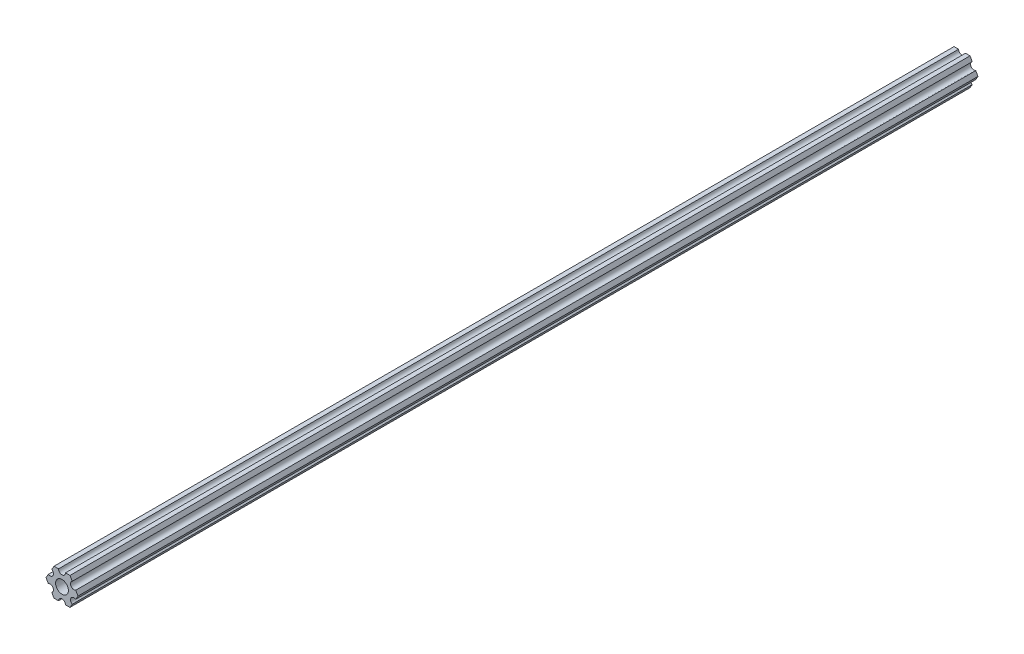
ISO-10303-21;
HEADER;
FILE_DESCRIPTION(('STEP AP214'),'2;1');
FILE_NAME('part.step','',(''),(''),'','','');
FILE_SCHEMA(('AUTOMOTIVE_DESIGN { 1 0 10303 214 1 1 1 1 }'));
ENDSEC;
DATA;
#1=APPLICATION_CONTEXT('core data for automotive mechanical design processes');
#2=APPLICATION_PROTOCOL_DEFINITION('international standard','automotive_design',2000,#1);
#3=PRODUCT_CONTEXT('',#1,'mechanical');
#4=PRODUCT('Part','Part','',(#3));
#5=PRODUCT_RELATED_PRODUCT_CATEGORY('part','',(#4));
#6=PRODUCT_DEFINITION_FORMATION('','',#4);
#7=PRODUCT_DEFINITION_CONTEXT('part definition',#1,'design');
#8=PRODUCT_DEFINITION('design','',#6,#7);
#9=PRODUCT_DEFINITION_SHAPE('','',#8);
#10=(LENGTH_UNIT() NAMED_UNIT(*) SI_UNIT(.MILLI.,.METRE.));
#11=(NAMED_UNIT(*) PLANE_ANGLE_UNIT() SI_UNIT($,.RADIAN.));
#12=(NAMED_UNIT(*) SI_UNIT($,.STERADIAN.) SOLID_ANGLE_UNIT());
#13=UNCERTAINTY_MEASURE_WITH_UNIT(LENGTH_MEASURE(1.E-05),#10,'distance_accuracy_value','');
#14=(GEOMETRIC_REPRESENTATION_CONTEXT(3) GLOBAL_UNCERTAINTY_ASSIGNED_CONTEXT((#13)) GLOBAL_UNIT_ASSIGNED_CONTEXT((#10,
#11,#12)) REPRESENTATION_CONTEXT('',''));
#15=CARTESIAN_POINT('',(0.,0.,0.));
#16=DIRECTION('',(0.,0.,1.));
#17=DIRECTION('',(1.,0.,0.));
#18=AXIS2_PLACEMENT_3D('',#15,#16,#17);
#19=CARTESIAN_POINT('',(6.29301142309098,-1.80018429024546,412.75));
#20=DIRECTION('',(-0.866025434075728,0.499999947533944,0.));
#21=DIRECTION('',(-0.499999947533944,-0.866025434075728,0.));
#22=AXIS2_PLACEMENT_3D('',#19,#20,#21);
#23=PLANE('',#22);
#24=DIRECTION('',(0.,0.,1.));
#25=VECTOR('',#24,1.);
#26=CARTESIAN_POINT('',(7.33234841870825,4.44212536187977E-07,412.75));
#27=LINE('',#26,#25);
#28=CARTESIAN_POINT('',(7.33234841870825,4.4421253590961E-07,0.));
#29=VERTEX_POINT('',#28);
#30=CARTESIAN_POINT('',(7.33234841870825,4.4421253664489E-07,412.75));
#31=VERTEX_POINT('',#30);
#32=EDGE_CURVE('E249',#29,#31,#27,.T.);
#33=ORIENTED_EDGE('',*,*,#32,.T.);
#34=DIRECTION('',(0.499999947533944,0.866025434075728,0.));
#35=VECTOR('',#34,1.);
#36=CARTESIAN_POINT('',(6.29301142309098,-1.80018429024546,412.75));
#37=LINE('',#36,#35);
#38=CARTESIAN_POINT('',(6.29301142309098,-1.80018429024546,412.75));
#39=VERTEX_POINT('',#38);
#40=EDGE_CURVE('E170',#39,#31,#37,.T.);
#41=ORIENTED_EDGE('',*,*,#40,.F.);
#42=DIRECTION('',(0.,0.,-1.));
#43=VECTOR('',#42,1.);
#44=CARTESIAN_POINT('',(6.29301142309098,-1.80018429024546,412.75));
#45=LINE('',#44,#43);
#46=CARTESIAN_POINT('',(6.29301142309098,-1.80018429024546,0.));
#47=VERTEX_POINT('',#46);
#48=EDGE_CURVE('E210',#39,#47,#45,.T.);
#49=ORIENTED_EDGE('',*,*,#48,.T.);
#50=DIRECTION('',(0.499999947533944,0.866025434075728,0.));
#51=VECTOR('',#50,1.);
#52=CARTESIAN_POINT('',(6.29301142309098,-1.80018429024546,0.));
#53=LINE('',#52,#51);
#54=EDGE_CURVE('E172',#47,#29,#53,.T.);
#55=ORIENTED_EDGE('',*,*,#54,.T.);
#56=EDGE_LOOP('',(#33,#41,#49,#55));
#57=FACE_BOUND('',#56,.T.);
#58=ADVANCED_FACE('F14',(#57),#23,.F.);
#59=CARTESIAN_POINT('',(7.33234841870825,4.44212536187977E-07,412.75));
#60=DIRECTION('',(-0.866025373493146,-0.500000052466055,0.));
#61=DIRECTION('',(0.500000052466055,-0.866025373493146,0.));
#62=AXIS2_PLACEMENT_3D('',#59,#60,#61);
#63=PLANE('',#62);
#64=DIRECTION('',(0.,0.,-1.));
#65=VECTOR('',#64,1.);
#66=CARTESIAN_POINT('',(6.29301120497139,1.80018505273895,412.75));
#67=LINE('',#66,#65);
#68=CARTESIAN_POINT('',(6.29301120497139,1.80018505273895,0.));
#69=VERTEX_POINT('',#68);
#70=CARTESIAN_POINT('',(6.29301120497139,1.80018505273895,412.75));
#71=VERTEX_POINT('',#70);
#72=EDGE_CURVE('E247',#69,#71,#67,.F.);
#73=ORIENTED_EDGE('',*,*,#72,.T.);
#74=DIRECTION('',(-0.500000052466055,0.866025373493145,0.));
#75=VECTOR('',#74,1.);
#76=CARTESIAN_POINT('',(7.33234841870825,4.44212536112459E-07,412.75));
#77=LINE('',#76,#75);
#78=EDGE_CURVE('E61',#31,#71,#77,.T.);
#79=ORIENTED_EDGE('',*,*,#78,.F.);
#80=ORIENTED_EDGE('',*,*,#32,.F.);
#81=DIRECTION('',(-0.500000052466055,0.866025373493145,0.));
#82=VECTOR('',#81,1.);
#83=CARTESIAN_POINT('',(7.33234841870825,4.44212536112459E-07,0.));
#84=LINE('',#83,#82);
#85=EDGE_CURVE('E207',#29,#69,#84,.T.);
#86=ORIENTED_EDGE('',*,*,#85,.T.);
#87=EDGE_LOOP('',(#73,#79,#80,#86));
#88=FACE_BOUND('',#87,.T.);
#89=ADVANCED_FACE('F294',(#88),#63,.F.);
#90=CARTESIAN_POINT('',(5.49926112168156,3.17500033315933,412.75));
#91=DIRECTION('',(0.,0.,-1.));
#92=DIRECTION('',(-1.,0.,0.));
#93=AXIS2_PLACEMENT_3D('',#90,#91,#92);
#94=CYLINDRICAL_SURFACE('',#93,1.5875);
#95=CARTESIAN_POINT('',(5.49926112168156,3.17500033315933,412.75));
#96=DIRECTION('',(0.,0.,-1.));
#97=DIRECTION('',(-1.,0.,0.));
#98=AXIS2_PLACEMENT_3D('',#95,#96,#97);
#99=CIRCLE('',#98,1.5875);
#100=CARTESIAN_POINT('',(4.70551103839172,4.54981561357972,412.75));
#101=VERTEX_POINT('',#100);
#102=EDGE_CURVE('E53',#71,#101,#99,.T.);
#103=ORIENTED_EDGE('',*,*,#102,.F.);
#104=ORIENTED_EDGE('',*,*,#72,.F.);
#105=CARTESIAN_POINT('',(5.49926112168156,3.17500033315933,0.));
#106=DIRECTION('',(0.,0.,-1.));
#107=DIRECTION('',(-1.,0.,0.));
#108=AXIS2_PLACEMENT_3D('',#105,#106,#107);
#109=CIRCLE('',#108,1.5875);
#110=CARTESIAN_POINT('',(4.70551103839172,4.54981561357972,0.));
#111=VERTEX_POINT('',#110);
#112=EDGE_CURVE('E17',#69,#111,#109,.T.);
#113=ORIENTED_EDGE('',*,*,#112,.T.);
#114=DIRECTION('',(0.,0.,1.));
#115=VECTOR('',#114,1.);
#116=CARTESIAN_POINT('',(4.70551103839172,4.54981561357972,412.75));
#117=LINE('',#116,#115);
#118=EDGE_CURVE('E245',#111,#101,#117,.T.);
#119=ORIENTED_EDGE('',*,*,#118,.T.);
#120=EDGE_LOOP('',(#103,#104,#113,#119));
#121=FACE_BOUND('',#120,.T.);
#122=ADVANCED_FACE('F292',(#121),#94,.F.);
#123=CARTESIAN_POINT('',(4.70551103839172,4.54981561357972,412.75));
#124=DIRECTION('',(-0.866025373493151,-0.500000052466046,0.));
#125=DIRECTION('',(0.500000052466046,-0.866025373493151,0.));
#126=AXIS2_PLACEMENT_3D('',#123,#124,#125);
#127=PLANE('',#126);
#128=DIRECTION('',(0.,0.,1.));
#129=VECTOR('',#128,1.);
#130=CARTESIAN_POINT('',(3.66617382465481,6.35000022210627,412.75));
#131=LINE('',#130,#129);
#132=CARTESIAN_POINT('',(3.66617382465481,6.35000022210627,-1.29526019539602E-13));
#133=VERTEX_POINT('',#132);
#134=CARTESIAN_POINT('',(3.66617382465481,6.35000022210627,412.75));
#135=VERTEX_POINT('',#134);
#136=EDGE_CURVE('E242',#133,#135,#131,.T.);
#137=ORIENTED_EDGE('',*,*,#136,.T.);
#138=DIRECTION('',(-0.500000052466046,0.866025373493151,0.));
#139=VECTOR('',#138,1.);
#140=CARTESIAN_POINT('',(4.70551103839172,4.54981561357972,412.75));
#141=LINE('',#140,#139);
#142=EDGE_CURVE('E167',#101,#135,#141,.T.);
#143=ORIENTED_EDGE('',*,*,#142,.F.);
#144=ORIENTED_EDGE('',*,*,#118,.F.);
#145=DIRECTION('',(-0.500000052466046,0.866025373493151,0.));
#146=VECTOR('',#145,1.);
#147=CARTESIAN_POINT('',(4.70551103839172,4.54981561357972,0.));
#148=LINE('',#147,#146);
#149=EDGE_CURVE('E204',#111,#133,#148,.T.);
#150=ORIENTED_EDGE('',*,*,#149,.T.);
#151=EDGE_LOOP('',(#137,#143,#144,#150));
#152=FACE_BOUND('',#151,.T.);
#153=ADVANCED_FACE('F285',(#152),#127,.F.);
#154=CARTESIAN_POINT('',(3.66617382465481,6.35000022210627,412.75));
#155=DIRECTION('',(6.05825850611185E-08,-0.999999999999998,0.));
#156=DIRECTION('',(0.999999999999998,6.05825850611185E-08,0.));
#157=AXIS2_PLACEMENT_3D('',#154,#155,#156);
#158=PLANE('',#157);
#159=DIRECTION('',(0.,0.,-1.));
#160=VECTOR('',#159,1.);
#161=CARTESIAN_POINT('',(1.58749961530074,6.35000009617482,412.75));
#162=LINE('',#161,#160);
#163=CARTESIAN_POINT('',(1.58749961530073,6.35000015914054,0.));
#164=VERTEX_POINT('',#163);
#165=CARTESIAN_POINT('',(1.58749961530073,6.35000015914054,412.75));
#166=VERTEX_POINT('',#165);
#167=EDGE_CURVE('E240',#164,#166,#162,.F.);
#168=ORIENTED_EDGE('',*,*,#167,.T.);
#169=DIRECTION('',(1.,0.,0.));
#170=VECTOR('',#169,1.);
#171=CARTESIAN_POINT('',(5.49926112168156,6.35000022210627,412.75));
#172=LINE('',#171,#170);
#173=EDGE_CURVE('E142',#135,#166,#172,.F.);
#174=ORIENTED_EDGE('',*,*,#173,.F.);
#175=ORIENTED_EDGE('',*,*,#136,.F.);
#176=DIRECTION('',(1.,0.,0.));
#177=VECTOR('',#176,1.);
#178=CARTESIAN_POINT('',(5.49926112168156,6.35000022210627,0.));
#179=LINE('',#178,#177);
#180=EDGE_CURVE('E201',#133,#164,#179,.F.);
#181=ORIENTED_EDGE('',*,*,#180,.T.);
#182=EDGE_LOOP('',(#168,#174,#175,#181));
#183=FACE_BOUND('',#182,.T.);
#184=ADVANCED_FACE('F282',(#183),#158,.F.);
#185=CARTESIAN_POINT('',(-3.84699260060323E-07,6.35,412.75));
#186=DIRECTION('',(0.,0.,-1.));
#187=DIRECTION('',(-1.,0.,0.));
#188=AXIS2_PLACEMENT_3D('',#185,#186,#187);
#189=CYLINDRICAL_SURFACE('',#188,1.5875);
#190=DIRECTION('',(0.,0.,1.));
#191=VECTOR('',#190,1.);
#192=CARTESIAN_POINT('',(-1.58750038469926,6.34999990382518,412.75));
#193=LINE('',#192,#191);
#194=CARTESIAN_POINT('',(-1.58750038469926,6.34999990382518,0.));
#195=VERTEX_POINT('',#194);
#196=CARTESIAN_POINT('',(-1.58750038469926,6.34999990382518,412.75));
#197=VERTEX_POINT('',#196);
#198=EDGE_CURVE('E101',#195,#197,#193,.T.);
#199=ORIENTED_EDGE('',*,*,#198,.T.);
#200=CARTESIAN_POINT('',(-3.84699260060323E-07,6.35,412.75));
#201=DIRECTION('',(0.,0.,-1.));
#202=DIRECTION('',(-1.,0.,0.));
#203=AXIS2_PLACEMENT_3D('',#200,#201,#202);
#204=CIRCLE('',#203,1.5875);
#205=EDGE_CURVE('E146',#166,#197,#204,.T.);
#206=ORIENTED_EDGE('',*,*,#205,.F.);
#207=ORIENTED_EDGE('',*,*,#167,.F.);
#208=CARTESIAN_POINT('',(-3.84699260060323E-07,6.35,0.));
#209=DIRECTION('',(0.,0.,-1.));
#210=DIRECTION('',(-1.,0.,0.));
#211=AXIS2_PLACEMENT_3D('',#208,#209,#210);
#212=CIRCLE('',#211,1.5875);
#213=EDGE_CURVE('E200',#164,#195,#212,.T.);
#214=ORIENTED_EDGE('',*,*,#213,.T.);
#215=EDGE_LOOP('',(#199,#206,#207,#214));
#216=FACE_BOUND('',#215,.T.);
#217=ADVANCED_FACE('F276',(#216),#189,.F.);
#218=CARTESIAN_POINT('',(-1.58750038469926,6.34999990382518,412.75));
#219=DIRECTION('',(6.05825963273174E-08,-0.999999999999998,0.));
#220=DIRECTION('',(0.999999999999998,6.05825963273174E-08,0.));
#221=AXIS2_PLACEMENT_3D('',#218,#219,#220);
#222=PLANE('',#221);
#223=DIRECTION('',(0.,0.,1.));
#224=VECTOR('',#223,1.);
#225=CARTESIAN_POINT('',(-3.66617459405349,6.3499997778937,412.75));
#226=LINE('',#225,#224);
#227=CARTESIAN_POINT('',(-3.66617454558244,6.34999986184803,-1.29526019539602E-13));
#228=VERTEX_POINT('',#227);
#229=CARTESIAN_POINT('',(-3.66617454558244,6.34999986184803,412.75));
#230=VERTEX_POINT('',#229);
#231=EDGE_CURVE('E109',#228,#230,#226,.T.);
#232=ORIENTED_EDGE('',*,*,#231,.T.);
#233=DIRECTION('',(1.,0.,0.));
#234=VECTOR('',#233,1.);
#235=CARTESIAN_POINT('',(5.49926112168156,6.34999990382518,412.75));
#236=LINE('',#235,#234);
#237=EDGE_CURVE('E147',#197,#230,#236,.F.);
#238=ORIENTED_EDGE('',*,*,#237,.F.);
#239=ORIENTED_EDGE('',*,*,#198,.F.);
#240=DIRECTION('',(1.,0.,0.));
#241=VECTOR('',#240,1.);
#242=CARTESIAN_POINT('',(5.49926112168156,6.34999990382518,0.));
#243=LINE('',#242,#241);
#244=EDGE_CURVE('E154',#195,#228,#243,.F.);
#245=ORIENTED_EDGE('',*,*,#244,.T.);
#246=EDGE_LOOP('',(#232,#238,#239,#245));
#247=FACE_BOUND('',#246,.T.);
#248=ADVANCED_FACE('F153',(#247),#222,.F.);
#249=CARTESIAN_POINT('',(-3.66617459405349,6.3499997778937,412.75));
#250=DIRECTION('',(0.866025434075729,-0.499999947533942,0.));
#251=DIRECTION('',(0.499999947533942,0.866025434075729,0.));
#252=AXIS2_PLACEMENT_3D('',#249,#250,#251);
#253=PLANE('',#252);
#254=DIRECTION('',(0.,0.,-1.));
#255=VECTOR('',#254,1.);
#256=CARTESIAN_POINT('',(-4.70551158967065,4.54981504343587,412.75));
#257=LINE('',#256,#255);
#258=CARTESIAN_POINT('',(-4.70551158967065,4.54981504343587,0.));
#259=VERTEX_POINT('',#258);
#260=CARTESIAN_POINT('',(-4.70551158967065,4.54981504343587,412.75));
#261=VERTEX_POINT('',#260);
#262=EDGE_CURVE('E155',#259,#261,#257,.F.);
#263=ORIENTED_EDGE('',*,*,#262,.T.);
#264=DIRECTION('',(-0.499999947533943,-0.866025434075729,0.));
#265=VECTOR('',#264,1.);
#266=CARTESIAN_POINT('',(-3.66617459405349,6.3499997778937,412.75));
#267=LINE('',#266,#265);
#268=EDGE_CURVE('E150',#230,#261,#267,.T.);
#269=ORIENTED_EDGE('',*,*,#268,.F.);
#270=ORIENTED_EDGE('',*,*,#231,.F.);
#271=DIRECTION('',(-0.499999947533943,-0.866025434075729,0.));
#272=VECTOR('',#271,1.);
#273=CARTESIAN_POINT('',(-3.66617459405349,6.3499997778937,0.));
#274=LINE('',#273,#272);
#275=EDGE_CURVE('E197',#228,#259,#274,.T.);
#276=ORIENTED_EDGE('',*,*,#275,.T.);
#277=EDGE_LOOP('',(#263,#269,#270,#276));
#278=FACE_BOUND('',#277,.T.);
#279=ADVANCED_FACE('F157',(#278),#253,.F.);
#280=CARTESIAN_POINT('',(-5.49926150638082,3.17499966684067,412.75));
#281=DIRECTION('',(0.,0.,-1.));
#282=DIRECTION('',(-1.,0.,0.));
#283=AXIS2_PLACEMENT_3D('',#280,#281,#282);
#284=CYLINDRICAL_SURFACE('',#283,1.5875);
#285=DIRECTION('',(0.,0.,1.));
#286=VECTOR('',#285,1.);
#287=CARTESIAN_POINT('',(-6.29301142309098,1.80018429024547,412.75));
#288=LINE('',#287,#286);
#289=CARTESIAN_POINT('',(-6.29301142309098,1.80018429024547,0.));
#290=VERTEX_POINT('',#289);
#291=CARTESIAN_POINT('',(-6.29301142309098,1.80018429024547,412.75));
#292=VERTEX_POINT('',#291);
#293=EDGE_CURVE('E235',#290,#292,#288,.T.);
#294=ORIENTED_EDGE('',*,*,#293,.T.);
#295=CARTESIAN_POINT('',(-5.49926150638082,3.17499966684067,412.75));
#296=DIRECTION('',(0.,0.,-1.));
#297=DIRECTION('',(-1.,0.,0.));
#298=AXIS2_PLACEMENT_3D('',#295,#296,#297);
#299=CIRCLE('',#298,1.5875);
#300=EDGE_CURVE('E159',#261,#292,#299,.T.);
#301=ORIENTED_EDGE('',*,*,#300,.F.);
#302=ORIENTED_EDGE('',*,*,#262,.F.);
#303=CARTESIAN_POINT('',(-5.49926150638082,3.17499966684067,0.));
#304=DIRECTION('',(0.,0.,-1.));
#305=DIRECTION('',(-1.,0.,0.));
#306=AXIS2_PLACEMENT_3D('',#303,#304,#305);
#307=CIRCLE('',#306,1.5875);
#308=EDGE_CURVE('E196',#259,#290,#307,.T.);
#309=ORIENTED_EDGE('',*,*,#308,.T.);
#310=EDGE_LOOP('',(#294,#301,#302,#309));
#311=FACE_BOUND('',#310,.T.);
#312=ADVANCED_FACE('F346',(#311),#284,.F.);
#313=CARTESIAN_POINT('',(-6.29301142309098,1.80018429024547,412.75));
#314=DIRECTION('',(0.866025434075724,-0.499999947533951,0.));
#315=DIRECTION('',(0.499999947533951,0.866025434075724,0.));
#316=AXIS2_PLACEMENT_3D('',#313,#314,#315);
#317=PLANE('',#316);
#318=DIRECTION('',(0.,0.,1.));
#319=VECTOR('',#318,1.);
#320=CARTESIAN_POINT('',(-7.33234841870826,-4.44212523790841E-07,412.75));
#321=LINE('',#320,#319);
#322=CARTESIAN_POINT('',(-7.33234841870826,-4.44212524036367E-07,0.));
#323=VERTEX_POINT('',#322);
#324=CARTESIAN_POINT('',(-7.33234841870826,-4.44212524036367E-07,412.75));
#325=VERTEX_POINT('',#324);
#326=EDGE_CURVE('E232',#323,#325,#321,.T.);
#327=ORIENTED_EDGE('',*,*,#326,.T.);
#328=DIRECTION('',(-0.499999947533952,-0.866025434075724,0.));
#329=VECTOR('',#328,1.);
#330=CARTESIAN_POINT('',(-6.29301142309098,1.80018429024547,412.75));
#331=LINE('',#330,#329);
#332=EDGE_CURVE('E161',#292,#325,#331,.T.);
#333=ORIENTED_EDGE('',*,*,#332,.F.);
#334=ORIENTED_EDGE('',*,*,#293,.F.);
#335=DIRECTION('',(-0.499999947533952,-0.866025434075724,0.));
#336=VECTOR('',#335,1.);
#337=CARTESIAN_POINT('',(-6.29301142309098,1.80018429024547,0.));
#338=LINE('',#337,#336);
#339=EDGE_CURVE('E193',#290,#323,#338,.T.);
#340=ORIENTED_EDGE('',*,*,#339,.T.);
#341=EDGE_LOOP('',(#327,#333,#334,#340));
#342=FACE_BOUND('',#341,.T.);
#343=ADVANCED_FACE('F314',(#342),#317,.F.);
#344=CARTESIAN_POINT('',(-7.33234841870826,-4.44212523790841E-07,412.75));
#345=DIRECTION('',(0.866025373493151,0.500000052466045,0.));
#346=DIRECTION('',(-0.500000052466045,0.866025373493151,0.));
#347=AXIS2_PLACEMENT_3D('',#344,#345,#346);
#348=PLANE('',#347);
#349=DIRECTION('',(0.,0.,-1.));
#350=VECTOR('',#349,1.);
#351=CARTESIAN_POINT('',(-6.29301120497141,-1.80018505273896,412.75));
#352=LINE('',#351,#350);
#353=CARTESIAN_POINT('',(-6.29301120497141,-1.80018505273896,0.));
#354=VERTEX_POINT('',#353);
#355=CARTESIAN_POINT('',(-6.29301120497141,-1.80018505273896,412.75));
#356=VERTEX_POINT('',#355);
#357=EDGE_CURVE('E229',#354,#356,#352,.F.);
#358=ORIENTED_EDGE('',*,*,#357,.T.);
#359=DIRECTION('',(0.500000052466045,-0.866025373493151,0.));
#360=VECTOR('',#359,1.);
#361=CARTESIAN_POINT('',(-7.33234841870826,-4.44212523969395E-07,412.75));
#362=LINE('',#361,#360);
#363=EDGE_CURVE('E262',#325,#356,#362,.T.);
#364=ORIENTED_EDGE('',*,*,#363,.F.);
#365=ORIENTED_EDGE('',*,*,#326,.F.);
#366=DIRECTION('',(0.500000052466045,-0.866025373493151,0.));
#367=VECTOR('',#366,1.);
#368=CARTESIAN_POINT('',(-7.33234841870826,-4.44212523969395E-07,0.));
#369=LINE('',#368,#367);
#370=EDGE_CURVE('E190',#323,#354,#369,.T.);
#371=ORIENTED_EDGE('',*,*,#370,.T.);
#372=EDGE_LOOP('',(#358,#364,#365,#371));
#373=FACE_BOUND('',#372,.T.);
#374=ADVANCED_FACE('F318',(#373),#348,.F.);
#375=CARTESIAN_POINT('',(-5.49926112168156,-3.17500033315934,412.75));
#376=DIRECTION('',(0.,0.,-1.));
#377=DIRECTION('',(-1.,0.,0.));
#378=AXIS2_PLACEMENT_3D('',#375,#376,#377);
#379=CYLINDRICAL_SURFACE('',#378,1.5875);
#380=DIRECTION('',(0.,0.,1.));
#381=VECTOR('',#380,1.);
#382=CARTESIAN_POINT('',(-4.70551103839172,-4.54981561357972,412.75));
#383=LINE('',#382,#381);
#384=CARTESIAN_POINT('',(-4.70551103839172,-4.54981561357972,0.));
#385=VERTEX_POINT('',#384);
#386=CARTESIAN_POINT('',(-4.70551103839172,-4.54981561357972,412.75));
#387=VERTEX_POINT('',#386);
#388=EDGE_CURVE('E226',#385,#387,#383,.T.);
#389=ORIENTED_EDGE('',*,*,#388,.T.);
#390=CARTESIAN_POINT('',(-5.49926112168156,-3.17500033315934,412.75));
#391=DIRECTION('',(0.,0.,-1.));
#392=DIRECTION('',(-1.,0.,0.));
#393=AXIS2_PLACEMENT_3D('',#390,#391,#392);
#394=CIRCLE('',#393,1.5875);
#395=EDGE_CURVE('E260',#356,#387,#394,.T.);
#396=ORIENTED_EDGE('',*,*,#395,.F.);
#397=ORIENTED_EDGE('',*,*,#357,.F.);
#398=CARTESIAN_POINT('',(-5.49926112168156,-3.17500033315934,0.));
#399=DIRECTION('',(0.,0.,-1.));
#400=DIRECTION('',(-1.,0.,0.));
#401=AXIS2_PLACEMENT_3D('',#398,#399,#400);
#402=CIRCLE('',#401,1.5875);
#403=EDGE_CURVE('E189',#354,#385,#402,.T.);
#404=ORIENTED_EDGE('',*,*,#403,.T.);
#405=EDGE_LOOP('',(#389,#396,#397,#404));
#406=FACE_BOUND('',#405,.T.);
#407=ADVANCED_FACE('F322',(#406),#379,.F.);
#408=CARTESIAN_POINT('',(-4.70551103839172,-4.54981561357972,412.75));
#409=DIRECTION('',(0.866025373493151,0.500000052466045,0.));
#410=DIRECTION('',(-0.500000052466045,0.866025373493151,0.));
#411=AXIS2_PLACEMENT_3D('',#408,#409,#410);
#412=PLANE('',#411);
#413=DIRECTION('',(0.,0.,1.));
#414=VECTOR('',#413,1.);
#415=CARTESIAN_POINT('',(-3.66617382465481,-6.35000022210628,412.75));
#416=LINE('',#415,#414);
#417=CARTESIAN_POINT('',(-3.6661738246548,-6.35000022210628,-1.29526019539602E-13));
#418=VERTEX_POINT('',#417);
#419=CARTESIAN_POINT('',(-3.6661738246548,-6.35000022210628,412.75));
#420=VERTEX_POINT('',#419);
#421=EDGE_CURVE('E223',#418,#420,#416,.T.);
#422=ORIENTED_EDGE('',*,*,#421,.T.);
#423=DIRECTION('',(0.500000052466045,-0.866025373493151,0.));
#424=VECTOR('',#423,1.);
#425=CARTESIAN_POINT('',(-4.70551103839172,-4.54981561357972,412.75));
#426=LINE('',#425,#424);
#427=EDGE_CURVE('E261',#387,#420,#426,.T.);
#428=ORIENTED_EDGE('',*,*,#427,.F.);
#429=ORIENTED_EDGE('',*,*,#388,.F.);
#430=DIRECTION('',(0.500000052466045,-0.866025373493151,0.));
#431=VECTOR('',#430,1.);
#432=CARTESIAN_POINT('',(-4.70551103839172,-4.54981561357972,0.));
#433=LINE('',#432,#431);
#434=EDGE_CURVE('E186',#385,#418,#433,.T.);
#435=ORIENTED_EDGE('',*,*,#434,.T.);
#436=EDGE_LOOP('',(#422,#428,#429,#435));
#437=FACE_BOUND('',#436,.T.);
#438=ADVANCED_FACE('F328',(#437),#412,.F.);
#439=CARTESIAN_POINT('',(-3.66617382465481,-6.35000022210628,412.75));
#440=DIRECTION('',(-6.05825854783851E-08,0.999999999999998,0.));
#441=DIRECTION('',(-0.999999999999998,-6.05825854783851E-08,0.));
#442=AXIS2_PLACEMENT_3D('',#439,#440,#441);
#443=PLANE('',#442);
#444=DIRECTION('',(0.,0.,-1.));
#445=VECTOR('',#444,1.);
#446=CARTESIAN_POINT('',(-1.58749961530074,-6.35,412.75));
#447=LINE('',#446,#445);
#448=CARTESIAN_POINT('',(-1.58749961530073,-6.35000011105314,0.));
#449=VERTEX_POINT('',#448);
#450=CARTESIAN_POINT('',(-1.58749961530073,-6.35000011105314,412.75));
#451=VERTEX_POINT('',#450);
#452=EDGE_CURVE('E220',#449,#451,#447,.F.);
#453=ORIENTED_EDGE('',*,*,#452,.T.);
#454=DIRECTION('',(1.,0.,0.));
#455=VECTOR('',#454,1.);
#456=CARTESIAN_POINT('',(5.49926112168156,-6.35000022210628,412.75));
#457=LINE('',#456,#455);
#458=EDGE_CURVE('E259',#420,#451,#457,.T.);
#459=ORIENTED_EDGE('',*,*,#458,.F.);
#460=ORIENTED_EDGE('',*,*,#421,.F.);
#461=DIRECTION('',(1.,0.,0.));
#462=VECTOR('',#461,1.);
#463=CARTESIAN_POINT('',(5.49926112168156,-6.35000022210628,0.));
#464=LINE('',#463,#462);
#465=EDGE_CURVE('E183',#418,#449,#464,.T.);
#466=ORIENTED_EDGE('',*,*,#465,.T.);
#467=EDGE_LOOP('',(#453,#459,#460,#466));
#468=FACE_BOUND('',#467,.T.);
#469=ADVANCED_FACE('F332',(#468),#443,.F.);
#470=CARTESIAN_POINT('',(3.8469926204343E-07,-6.35,412.75));
#471=DIRECTION('',(0.,0.,-1.));
#472=DIRECTION('',(-1.,0.,0.));
#473=AXIS2_PLACEMENT_3D('',#470,#471,#472);
#474=CYLINDRICAL_SURFACE('',#473,1.5875);
#475=DIRECTION('',(0.,0.,1.));
#476=VECTOR('',#475,1.);
#477=CARTESIAN_POINT('',(1.58750038469926,-6.34999990382518,412.75));
#478=LINE('',#477,#476);
#479=CARTESIAN_POINT('',(1.58750038469926,-6.34999990382518,0.));
#480=VERTEX_POINT('',#479);
#481=CARTESIAN_POINT('',(1.58750038469926,-6.34999990382518,412.75));
#482=VERTEX_POINT('',#481);
#483=EDGE_CURVE('E217',#480,#482,#478,.T.);
#484=ORIENTED_EDGE('',*,*,#483,.T.);
#485=CARTESIAN_POINT('',(3.8469926204343E-07,-6.35,412.75));
#486=DIRECTION('',(0.,0.,-1.));
#487=DIRECTION('',(-1.,0.,0.));
#488=AXIS2_PLACEMENT_3D('',#485,#486,#487);
#489=CIRCLE('',#488,1.5875);
#490=EDGE_CURVE('E256',#451,#482,#489,.T.);
#491=ORIENTED_EDGE('',*,*,#490,.F.);
#492=ORIENTED_EDGE('',*,*,#452,.F.);
#493=CARTESIAN_POINT('',(3.8469926204343E-07,-6.35,0.));
#494=DIRECTION('',(0.,0.,-1.));
#495=DIRECTION('',(-1.,0.,0.));
#496=AXIS2_PLACEMENT_3D('',#493,#494,#495);
#497=CIRCLE('',#496,1.5875);
#498=EDGE_CURVE('E182',#449,#480,#497,.T.);
#499=ORIENTED_EDGE('',*,*,#498,.T.);
#500=EDGE_LOOP('',(#484,#491,#492,#499));
#501=FACE_BOUND('',#500,.T.);
#502=ADVANCED_FACE('F336',(#501),#474,.F.);
#503=CARTESIAN_POINT('',(1.58750038469926,-6.34999990382518,412.75));
#504=DIRECTION('',(-6.05825721258438E-08,0.999999999999998,0.));
#505=DIRECTION('',(-0.999999999999998,-6.05825721258438E-08,0.));
#506=AXIS2_PLACEMENT_3D('',#503,#504,#505);
#507=PLANE('',#506);
#508=DIRECTION('',(0.,0.,1.));
#509=VECTOR('',#508,1.);
#510=CARTESIAN_POINT('',(3.66617459405346,-6.34999977789375,412.75));
#511=LINE('',#510,#509);
#512=CARTESIAN_POINT('',(3.66617454558244,-6.34999986184804,-1.29526019539602E-13));
#513=VERTEX_POINT('',#512);
#514=CARTESIAN_POINT('',(3.66617454558244,-6.34999986184804,412.75));
#515=VERTEX_POINT('',#514);
#516=EDGE_CURVE('E214',#513,#515,#511,.T.);
#517=ORIENTED_EDGE('',*,*,#516,.T.);
#518=DIRECTION('',(1.,0.,0.));
#519=VECTOR('',#518,1.);
#520=CARTESIAN_POINT('',(5.49926112168156,-6.34999990382518,412.75));
#521=LINE('',#520,#519);
#522=EDGE_CURVE('E258',#482,#515,#521,.T.);
#523=ORIENTED_EDGE('',*,*,#522,.F.);
#524=ORIENTED_EDGE('',*,*,#483,.F.);
#525=DIRECTION('',(1.,0.,0.));
#526=VECTOR('',#525,1.);
#527=CARTESIAN_POINT('',(5.49926112168156,-6.34999990382518,0.));
#528=LINE('',#527,#526);
#529=EDGE_CURVE('E179',#480,#513,#528,.T.);
#530=ORIENTED_EDGE('',*,*,#529,.T.);
#531=EDGE_LOOP('',(#517,#523,#524,#530));
#532=FACE_BOUND('',#531,.T.);
#533=ADVANCED_FACE('F339',(#532),#507,.F.);
#534=CARTESIAN_POINT('',(3.66617459405346,-6.34999977789375,412.75));
#535=DIRECTION('',(-0.86602543407573,0.499999947533941,0.));
#536=DIRECTION('',(-0.499999947533941,-0.86602543407573,0.));
#537=AXIS2_PLACEMENT_3D('',#534,#535,#536);
#538=PLANE('',#537);
#539=DIRECTION('',(0.,0.,1.));
#540=VECTOR('',#539,1.);
#541=CARTESIAN_POINT('',(4.70551158967065,-4.54981504343587,412.75));
#542=LINE('',#541,#540);
#543=CARTESIAN_POINT('',(4.70551158967065,-4.54981504343587,412.75));
#544=VERTEX_POINT('',#543);
#545=CARTESIAN_POINT('',(4.70551158967065,-4.54981504343587,0.));
#546=VERTEX_POINT('',#545);
#547=EDGE_CURVE('E212',#544,#546,#542,.F.);
#548=ORIENTED_EDGE('',*,*,#547,.F.);
#549=DIRECTION('',(0.49999994753394,0.86602543407573,0.));
#550=VECTOR('',#549,1.);
#551=CARTESIAN_POINT('',(3.66617459405346,-6.34999977789376,412.75));
#552=LINE('',#551,#550);
#553=EDGE_CURVE('E255',#515,#544,#552,.T.);
#554=ORIENTED_EDGE('',*,*,#553,.F.);
#555=ORIENTED_EDGE('',*,*,#516,.F.);
#556=DIRECTION('',(0.49999994753394,0.86602543407573,0.));
#557=VECTOR('',#556,1.);
#558=CARTESIAN_POINT('',(3.66617459405346,-6.34999977789376,0.));
#559=LINE('',#558,#557);
#560=EDGE_CURVE('E176',#513,#546,#559,.T.);
#561=ORIENTED_EDGE('',*,*,#560,.T.);
#562=EDGE_LOOP('',(#548,#554,#555,#561));
#563=FACE_BOUND('',#562,.T.);
#564=ADVANCED_FACE('F341',(#563),#538,.F.);
#565=CARTESIAN_POINT('',(5.49926150638082,-3.17499966684067,412.75));
#566=DIRECTION('',(0.,0.,-1.));
#567=DIRECTION('',(-1.,0.,0.));
#568=AXIS2_PLACEMENT_3D('',#565,#566,#567);
#569=CYLINDRICAL_SURFACE('',#568,1.58750000000001);
#570=CARTESIAN_POINT('',(5.49926150638082,-3.17499966684067,412.75));
#571=DIRECTION('',(0.,0.,-1.));
#572=DIRECTION('',(-1.,0.,0.));
#573=AXIS2_PLACEMENT_3D('',#570,#571,#572);
#574=CIRCLE('',#573,1.58750000000001);
#575=EDGE_CURVE('E32',#544,#39,#574,.T.);
#576=ORIENTED_EDGE('',*,*,#575,.F.);
#577=ORIENTED_EDGE('',*,*,#547,.T.);
#578=CARTESIAN_POINT('',(5.49926150638082,-3.17499966684067,0.));
#579=DIRECTION('',(0.,0.,-1.));
#580=DIRECTION('',(-1.,0.,0.));
#581=AXIS2_PLACEMENT_3D('',#578,#579,#580);
#582=CIRCLE('',#581,1.58750000000001);
#583=EDGE_CURVE('E175',#546,#47,#582,.T.);
#584=ORIENTED_EDGE('',*,*,#583,.T.);
#585=ORIENTED_EDGE('',*,*,#48,.F.);
#586=EDGE_LOOP('',(#576,#577,#584,#585));
#587=FACE_BOUND('',#586,.T.);
#588=ADVANCED_FACE('F298',(#587),#569,.F.);
#589=CARTESIAN_POINT('',(5.49926112168156,3.17500033315933,0.));
#590=DIRECTION('',(0.,0.,1.));
#591=DIRECTION('',(1.,0.,0.));
#592=AXIS2_PLACEMENT_3D('',#589,#590,#591);
#593=PLANE('',#592);
#594=CARTESIAN_POINT('',(0.,0.,0.));
#595=DIRECTION('',(0.,0.,-1.));
#596=DIRECTION('',(-1.,0.,0.));
#597=AXIS2_PLACEMENT_3D('',#594,#595,#596);
#598=CIRCLE('',#597,2.9337);
#599=CARTESIAN_POINT('',(-2.9337,0.,0.));
#600=VERTEX_POINT('',#599);
#601=EDGE_CURVE('E23',#600,#600,#598,.F.);
#602=ORIENTED_EDGE('',*,*,#601,.T.);
#603=EDGE_LOOP('',(#602));
#604=FACE_BOUND('',#603,.T.);
#605=ORIENTED_EDGE('',*,*,#583,.F.);
#606=ORIENTED_EDGE('',*,*,#560,.F.);
#607=ORIENTED_EDGE('',*,*,#529,.F.);
#608=ORIENTED_EDGE('',*,*,#498,.F.);
#609=ORIENTED_EDGE('',*,*,#465,.F.);
#610=ORIENTED_EDGE('',*,*,#434,.F.);
#611=ORIENTED_EDGE('',*,*,#403,.F.);
#612=ORIENTED_EDGE('',*,*,#370,.F.);
#613=ORIENTED_EDGE('',*,*,#339,.F.);
#614=ORIENTED_EDGE('',*,*,#308,.F.);
#615=ORIENTED_EDGE('',*,*,#275,.F.);
#616=ORIENTED_EDGE('',*,*,#244,.F.);
#617=ORIENTED_EDGE('',*,*,#213,.F.);
#618=ORIENTED_EDGE('',*,*,#180,.F.);
#619=ORIENTED_EDGE('',*,*,#149,.F.);
#620=ORIENTED_EDGE('',*,*,#112,.F.);
#621=ORIENTED_EDGE('',*,*,#85,.F.);
#622=ORIENTED_EDGE('',*,*,#54,.F.);
#623=EDGE_LOOP('',(#605,#606,#607,#608,#609,#610,#611,#612,#613,#614,#615,#616,#617,#618,#619,
#620,#621,#622));
#624=FACE_BOUND('',#623,.T.);
#625=ADVANCED_FACE('F279',(#604,#624),#593,.F.);
#626=CARTESIAN_POINT('',(5.49926112168156,3.17500033315933,412.75));
#627=DIRECTION('',(0.,0.,1.));
#628=DIRECTION('',(1.,0.,0.));
#629=AXIS2_PLACEMENT_3D('',#626,#627,#628);
#630=PLANE('',#629);
#631=CARTESIAN_POINT('',(0.,0.,412.75));
#632=DIRECTION('',(0.,0.,-1.));
#633=DIRECTION('',(-1.,0.,0.));
#634=AXIS2_PLACEMENT_3D('',#631,#632,#633);
#635=CIRCLE('',#634,2.9337);
#636=CARTESIAN_POINT('',(-2.9337,0.,412.75));
#637=VERTEX_POINT('',#636);
#638=EDGE_CURVE('E9',#637,#637,#635,.T.);
#639=ORIENTED_EDGE('',*,*,#638,.T.);
#640=EDGE_LOOP('',(#639));
#641=FACE_BOUND('',#640,.T.);
#642=ORIENTED_EDGE('',*,*,#553,.T.);
#643=ORIENTED_EDGE('',*,*,#575,.T.);
#644=ORIENTED_EDGE('',*,*,#40,.T.);
#645=ORIENTED_EDGE('',*,*,#78,.T.);
#646=ORIENTED_EDGE('',*,*,#102,.T.);
#647=ORIENTED_EDGE('',*,*,#142,.T.);
#648=ORIENTED_EDGE('',*,*,#173,.T.);
#649=ORIENTED_EDGE('',*,*,#205,.T.);
#650=ORIENTED_EDGE('',*,*,#237,.T.);
#651=ORIENTED_EDGE('',*,*,#268,.T.);
#652=ORIENTED_EDGE('',*,*,#300,.T.);
#653=ORIENTED_EDGE('',*,*,#332,.T.);
#654=ORIENTED_EDGE('',*,*,#363,.T.);
#655=ORIENTED_EDGE('',*,*,#395,.T.);
#656=ORIENTED_EDGE('',*,*,#427,.T.);
#657=ORIENTED_EDGE('',*,*,#458,.T.);
#658=ORIENTED_EDGE('',*,*,#490,.T.);
#659=ORIENTED_EDGE('',*,*,#522,.T.);
#660=EDGE_LOOP('',(#642,#643,#644,#645,#646,#647,#648,#649,#650,#651,#652,#653,#654,#655,#656,
#657,#658,#659));
#661=FACE_BOUND('',#660,.T.);
#662=ADVANCED_FACE('F149',(#641,#661),#630,.T.);
#663=CARTESIAN_POINT('',(0.,0.,412.75));
#664=DIRECTION('',(0.,0.,-1.));
#665=DIRECTION('',(-1.,0.,0.));
#666=AXIS2_PLACEMENT_3D('',#663,#664,#665);
#667=CYLINDRICAL_SURFACE('',#666,2.9337);
#668=ORIENTED_EDGE('',*,*,#601,.F.);
#669=EDGE_LOOP('',(#668));
#670=FACE_BOUND('',#669,.T.);
#671=ORIENTED_EDGE('',*,*,#638,.F.);
#672=EDGE_LOOP('',(#671));
#673=FACE_BOUND('',#672,.T.);
#674=ADVANCED_FACE('F356',(#670,#673),#667,.F.);
#675=CLOSED_SHELL('',(#58,#89,#122,#153,#184,#217,#248,#279,#312,#343,#374,#407,#438,#469,#502,
#533,#564,#588,#625,#662,#674));
#676=MANIFOLD_SOLID_BREP('B1',#675);
#677=ADVANCED_BREP_SHAPE_REPRESENTATION('',(#18,#676),#14);
#678=SHAPE_DEFINITION_REPRESENTATION(#9,#677);
ENDSEC;
END-ISO-10303-21;
